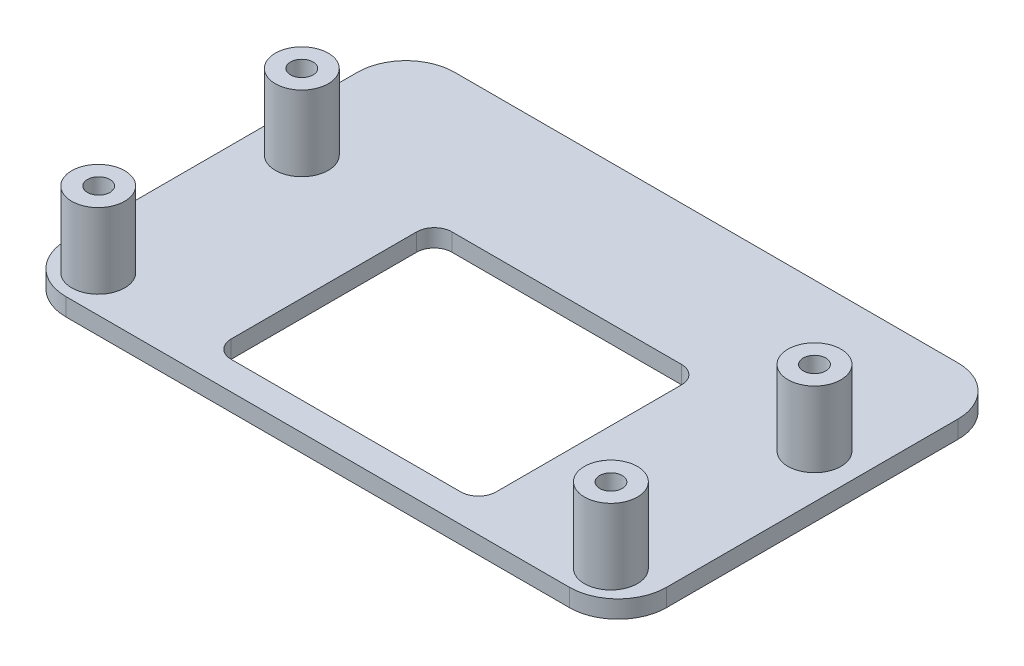
ISO-10303-21;
HEADER;
FILE_DESCRIPTION(('STEP AP214'),'2;1');
FILE_NAME('part.step','',(''),(''),'','','');
FILE_SCHEMA(('AUTOMOTIVE_DESIGN { 1 0 10303 214 1 1 1 1 }'));
ENDSEC;
DATA;
#1=APPLICATION_CONTEXT('core data for automotive mechanical design processes');
#2=APPLICATION_PROTOCOL_DEFINITION('international standard','automotive_design',2000,#1);
#3=PRODUCT_CONTEXT('',#1,'mechanical');
#4=PRODUCT('Part','Part','',(#3));
#5=PRODUCT_RELATED_PRODUCT_CATEGORY('part','',(#4));
#6=PRODUCT_DEFINITION_FORMATION('','',#4);
#7=PRODUCT_DEFINITION_CONTEXT('part definition',#1,'design');
#8=PRODUCT_DEFINITION('design','',#6,#7);
#9=PRODUCT_DEFINITION_SHAPE('','',#8);
#10=(LENGTH_UNIT() NAMED_UNIT(*) SI_UNIT(.MILLI.,.METRE.));
#11=(NAMED_UNIT(*) PLANE_ANGLE_UNIT() SI_UNIT($,.RADIAN.));
#12=(NAMED_UNIT(*) SI_UNIT($,.STERADIAN.) SOLID_ANGLE_UNIT());
#13=UNCERTAINTY_MEASURE_WITH_UNIT(LENGTH_MEASURE(1.E-05),#10,'distance_accuracy_value','');
#14=(GEOMETRIC_REPRESENTATION_CONTEXT(3) GLOBAL_UNCERTAINTY_ASSIGNED_CONTEXT((#13)) GLOBAL_UNIT_ASSIGNED_CONTEXT((#10,
#11,#12)) REPRESENTATION_CONTEXT('',''));
#15=CARTESIAN_POINT('',(0.,0.,0.));
#16=DIRECTION('',(0.,0.,1.));
#17=DIRECTION('',(1.,0.,0.));
#18=AXIS2_PLACEMENT_3D('',#15,#16,#17);
#19=CARTESIAN_POINT('',(-34.4994350282486,2.,-19.3242937853107));
#20=DIRECTION('',(1.,0.,0.));
#21=DIRECTION('',(0.,0.,-1.));
#22=AXIS2_PLACEMENT_3D('',#19,#20,#21);
#23=PLANE('',#22);
#24=DIRECTION('',(0.,0.,1.));
#25=VECTOR('',#24,1.);
#26=CARTESIAN_POINT('',(-34.4994350282486,0.,-19.3242937853107));
#27=LINE('',#26,#25);
#28=CARTESIAN_POINT('',(-34.4994350282486,0.,-13.8242937853107));
#29=VERTEX_POINT('',#28);
#30=CARTESIAN_POINT('',(-34.4994350282486,0.,19.1757062146893));
#31=VERTEX_POINT('',#30);
#32=EDGE_CURVE('E276',#29,#31,#27,.T.);
#33=ORIENTED_EDGE('',*,*,#32,.T.);
#34=DIRECTION('',(0.,-1.,0.));
#35=VECTOR('',#34,1.);
#36=CARTESIAN_POINT('',(-34.4994350282486,2.,19.1757062146893));
#37=LINE('',#36,#35);
#38=CARTESIAN_POINT('',(-34.4994350282486,2.,19.1757062146893));
#39=VERTEX_POINT('',#38);
#40=EDGE_CURVE('E212',#31,#39,#37,.F.);
#41=ORIENTED_EDGE('',*,*,#40,.T.);
#42=DIRECTION('',(0.,0.,1.));
#43=VECTOR('',#42,1.);
#44=CARTESIAN_POINT('',(-34.4994350282486,2.,-19.3242937853107));
#45=LINE('',#44,#43);
#46=CARTESIAN_POINT('',(-34.4994350282486,2.,-13.8242937853107));
#47=VERTEX_POINT('',#46);
#48=EDGE_CURVE('E178',#47,#39,#45,.T.);
#49=ORIENTED_EDGE('',*,*,#48,.F.);
#50=DIRECTION('',(0.,-1.,0.));
#51=VECTOR('',#50,1.);
#52=CARTESIAN_POINT('',(-34.4994350282486,2.,-13.8242937853107));
#53=LINE('',#52,#51);
#54=EDGE_CURVE('E209',#47,#29,#53,.T.);
#55=ORIENTED_EDGE('',*,*,#54,.T.);
#56=EDGE_LOOP('',(#33,#41,#49,#55));
#57=FACE_BOUND('',#56,.T.);
#58=ADVANCED_FACE('F39',(#57),#23,.F.);
#59=CARTESIAN_POINT('',(-34.4994350282486,2.,24.6757062146893));
#60=DIRECTION('',(0.,0.,-1.));
#61=DIRECTION('',(-1.,0.,0.));
#62=AXIS2_PLACEMENT_3D('',#59,#60,#61);
#63=PLANE('',#62);
#64=DIRECTION('',(1.,0.,0.));
#65=VECTOR('',#64,1.);
#66=CARTESIAN_POINT('',(-34.4994350282486,0.,24.6757062146893));
#67=LINE('',#66,#65);
#68=CARTESIAN_POINT('',(-28.9994350282486,0.,24.6757062146893));
#69=VERTEX_POINT('',#68);
#70=CARTESIAN_POINT('',(28.0005649717514,0.,24.6757062146893));
#71=VERTEX_POINT('',#70);
#72=EDGE_CURVE('E184',#69,#71,#67,.T.);
#73=ORIENTED_EDGE('',*,*,#72,.T.);
#74=DIRECTION('',(0.,-1.,0.));
#75=VECTOR('',#74,1.);
#76=CARTESIAN_POINT('',(28.0005649717514,2.,24.6757062146893));
#77=LINE('',#76,#75);
#78=CARTESIAN_POINT('',(28.0005649717514,2.,24.6757062146893));
#79=VERTEX_POINT('',#78);
#80=EDGE_CURVE('E207',#71,#79,#77,.F.);
#81=ORIENTED_EDGE('',*,*,#80,.T.);
#82=DIRECTION('',(1.,0.,0.));
#83=VECTOR('',#82,1.);
#84=CARTESIAN_POINT('',(-34.4994350282486,2.,24.6757062146893));
#85=LINE('',#84,#83);
#86=CARTESIAN_POINT('',(-28.9994350282486,2.,24.6757062146893));
#87=VERTEX_POINT('',#86);
#88=EDGE_CURVE('E182',#87,#79,#85,.T.);
#89=ORIENTED_EDGE('',*,*,#88,.F.);
#90=DIRECTION('',(0.,-1.,0.));
#91=VECTOR('',#90,1.);
#92=CARTESIAN_POINT('',(-28.9994350282486,2.,24.6757062146893));
#93=LINE('',#92,#91);
#94=EDGE_CURVE('E204',#87,#69,#93,.T.);
#95=ORIENTED_EDGE('',*,*,#94,.T.);
#96=EDGE_LOOP('',(#73,#81,#89,#95));
#97=FACE_BOUND('',#96,.T.);
#98=ADVANCED_FACE('F295',(#97),#63,.F.);
#99=CARTESIAN_POINT('',(33.5005649717514,2.,-19.3242937853107));
#100=DIRECTION('',(-1.,0.,0.));
#101=DIRECTION('',(0.,0.,1.));
#102=AXIS2_PLACEMENT_3D('',#99,#100,#101);
#103=PLANE('',#102);
#104=DIRECTION('',(0.,0.,-1.));
#105=VECTOR('',#104,1.);
#106=CARTESIAN_POINT('',(33.5005649717514,0.,-19.3242937853107));
#107=LINE('',#106,#105);
#108=CARTESIAN_POINT('',(33.5005649717514,0.,19.1757062146893));
#109=VERTEX_POINT('',#108);
#110=CARTESIAN_POINT('',(33.5005649717514,0.,-13.8242937853107));
#111=VERTEX_POINT('',#110);
#112=EDGE_CURVE('E179',#109,#111,#107,.T.);
#113=ORIENTED_EDGE('',*,*,#112,.T.);
#114=DIRECTION('',(0.,-1.,0.));
#115=VECTOR('',#114,1.);
#116=CARTESIAN_POINT('',(33.5005649717514,2.,-13.8242937853107));
#117=LINE('',#116,#115);
#118=CARTESIAN_POINT('',(33.5005649717514,2.,-13.8242937853107));
#119=VERTEX_POINT('',#118);
#120=EDGE_CURVE('E157',#111,#119,#117,.F.);
#121=ORIENTED_EDGE('',*,*,#120,.T.);
#122=DIRECTION('',(0.,0.,-1.));
#123=VECTOR('',#122,1.);
#124=CARTESIAN_POINT('',(33.5005649717514,2.,-19.3242937853107));
#125=LINE('',#124,#123);
#126=CARTESIAN_POINT('',(33.5005649717514,2.,19.1757062146893));
#127=VERTEX_POINT('',#126);
#128=EDGE_CURVE('E286',#127,#119,#125,.T.);
#129=ORIENTED_EDGE('',*,*,#128,.F.);
#130=DIRECTION('',(0.,-1.,0.));
#131=VECTOR('',#130,1.);
#132=CARTESIAN_POINT('',(33.5005649717514,2.,19.1757062146893));
#133=LINE('',#132,#131);
#134=EDGE_CURVE('E162',#127,#109,#133,.T.);
#135=ORIENTED_EDGE('',*,*,#134,.T.);
#136=EDGE_LOOP('',(#113,#121,#129,#135));
#137=FACE_BOUND('',#136,.T.);
#138=ADVANCED_FACE('F306',(#137),#103,.F.);
#139=CARTESIAN_POINT('',(-34.4994350282486,2.,-19.3242937853107));
#140=DIRECTION('',(0.,0.,1.));
#141=DIRECTION('',(1.,0.,0.));
#142=AXIS2_PLACEMENT_3D('',#139,#140,#141);
#143=PLANE('',#142);
#144=DIRECTION('',(-1.,0.,0.));
#145=VECTOR('',#144,1.);
#146=CARTESIAN_POINT('',(-34.4994350282486,2.,-19.3242937853107));
#147=LINE('',#146,#145);
#148=CARTESIAN_POINT('',(28.0005649717514,2.,-19.3242937853107));
#149=VERTEX_POINT('',#148);
#150=CARTESIAN_POINT('',(-28.9994350282486,2.,-19.3242937853107));
#151=VERTEX_POINT('',#150);
#152=EDGE_CURVE('E172',#149,#151,#147,.T.);
#153=ORIENTED_EDGE('',*,*,#152,.F.);
#154=DIRECTION('',(0.,-1.,0.));
#155=VECTOR('',#154,1.);
#156=CARTESIAN_POINT('',(28.0005649717514,2.,-19.3242937853107));
#157=LINE('',#156,#155);
#158=CARTESIAN_POINT('',(28.0005649717514,0.,-19.3242937853107));
#159=VERTEX_POINT('',#158);
#160=EDGE_CURVE('E156',#149,#159,#157,.T.);
#161=ORIENTED_EDGE('',*,*,#160,.T.);
#162=DIRECTION('',(-1.,0.,0.));
#163=VECTOR('',#162,1.);
#164=CARTESIAN_POINT('',(-34.4994350282486,0.,-19.3242937853107));
#165=LINE('',#164,#163);
#166=CARTESIAN_POINT('',(-28.9994350282486,0.,-19.3242937853107));
#167=VERTEX_POINT('',#166);
#168=EDGE_CURVE('E169',#159,#167,#165,.T.);
#169=ORIENTED_EDGE('',*,*,#168,.T.);
#170=DIRECTION('',(0.,-1.,0.));
#171=VECTOR('',#170,1.);
#172=CARTESIAN_POINT('',(-28.9994350282486,2.,-19.3242937853107));
#173=LINE('',#172,#171);
#174=EDGE_CURVE('E174',#167,#151,#173,.F.);
#175=ORIENTED_EDGE('',*,*,#174,.T.);
#176=EDGE_LOOP('',(#153,#161,#169,#175));
#177=FACE_BOUND('',#176,.T.);
#178=ADVANCED_FACE('F168',(#177),#143,.F.);
#179=CARTESIAN_POINT('',(0.,2.,0.));
#180=DIRECTION('',(0.,1.,0.));
#181=DIRECTION('',(0.,0.,1.));
#182=AXIS2_PLACEMENT_3D('',#179,#180,#181);
#183=PLANE('',#182);
#184=CARTESIAN_POINT('',(28.5255649717514,2.,-2.54929378531089));
#185=DIRECTION('',(0.,1.,0.));
#186=DIRECTION('',(0.,0.,1.));
#187=AXIS2_PLACEMENT_3D('',#184,#185,#186);
#188=CIRCLE('',#187,3.);
#189=CARTESIAN_POINT('',(28.5255649717514,2.,0.450706214689113));
#190=VERTEX_POINT('',#189);
#191=EDGE_CURVE('E709',#190,#190,#188,.T.);
#192=ORIENTED_EDGE('',*,*,#191,.F.);
#193=EDGE_LOOP('',(#192));
#194=FACE_BOUND('',#193,.T.);
#195=CARTESIAN_POINT('',(28.5005649717514,2.,20.4757062146893));
#196=DIRECTION('',(0.,1.,0.));
#197=DIRECTION('',(0.,0.,1.));
#198=AXIS2_PLACEMENT_3D('',#195,#196,#197);
#199=CIRCLE('',#198,3.);
#200=CARTESIAN_POINT('',(28.5005649717514,2.,23.4757062146893));
#201=VERTEX_POINT('',#200);
#202=EDGE_CURVE('E719',#201,#201,#199,.T.);
#203=ORIENTED_EDGE('',*,*,#202,.F.);
#204=EDGE_LOOP('',(#203));
#205=FACE_BOUND('',#204,.T.);
#206=CARTESIAN_POINT('',(-29.5244350282485,2.,20.5007062146895));
#207=DIRECTION('',(0.,1.,0.));
#208=DIRECTION('',(0.,0.,1.));
#209=AXIS2_PLACEMENT_3D('',#206,#207,#208);
#210=CIRCLE('',#209,3.);
#211=CARTESIAN_POINT('',(-29.5244350282485,2.,23.5007062146895));
#212=VERTEX_POINT('',#211);
#213=EDGE_CURVE('E725',#212,#212,#210,.T.);
#214=ORIENTED_EDGE('',*,*,#213,.F.);
#215=EDGE_LOOP('',(#214));
#216=FACE_BOUND('',#215,.T.);
#217=CARTESIAN_POINT('',(-29.5244350282486,2.,-2.54929378531047));
#218=DIRECTION('',(0.,1.,0.));
#219=DIRECTION('',(0.,0.,1.));
#220=AXIS2_PLACEMENT_3D('',#217,#218,#219);
#221=CIRCLE('',#220,3.);
#222=CARTESIAN_POINT('',(-29.5244350282486,2.,0.450706214689527));
#223=VERTEX_POINT('',#222);
#224=EDGE_CURVE('E269',#223,#223,#221,.T.);
#225=ORIENTED_EDGE('',*,*,#224,.F.);
#226=EDGE_LOOP('',(#225));
#227=FACE_BOUND('',#226,.T.);
#228=DIRECTION('',(1.,0.,0.));
#229=VECTOR('',#228,1.);
#230=CARTESIAN_POINT('',(-15.4994350282486,2.,-3.52429378531069));
#231=LINE('',#230,#229);
#232=CARTESIAN_POINT('',(-13.4994350282486,2.,-3.52429378531069));
#233=VERTEX_POINT('',#232);
#234=CARTESIAN_POINT('',(12.5005649717514,2.,-3.52429378531069));
#235=VERTEX_POINT('',#234);
#236=EDGE_CURVE('E274',#233,#235,#231,.T.);
#237=ORIENTED_EDGE('',*,*,#236,.T.);
#238=CARTESIAN_POINT('',(12.5005649717514,2.,-1.52429378531069));
#239=DIRECTION('',(0.,1.,0.));
#240=DIRECTION('',(0.,0.,1.));
#241=AXIS2_PLACEMENT_3D('',#238,#239,#240);
#242=CIRCLE('',#241,2.);
#243=CARTESIAN_POINT('',(14.5005649717514,2.,-1.52429378531069));
#244=VERTEX_POINT('',#243);
#245=EDGE_CURVE('E11',#235,#244,#242,.F.);
#246=ORIENTED_EDGE('',*,*,#245,.T.);
#247=DIRECTION('',(0.,0.,1.));
#248=VECTOR('',#247,1.);
#249=CARTESIAN_POINT('',(14.5005649717514,2.,21.4757062146893));
#250=LINE('',#249,#248);
#251=CARTESIAN_POINT('',(14.5005649717514,2.,19.4757062146893));
#252=VERTEX_POINT('',#251);
#253=EDGE_CURVE('E258',#244,#252,#250,.T.);
#254=ORIENTED_EDGE('',*,*,#253,.T.);
#255=CARTESIAN_POINT('',(12.5005649717514,2.,19.4757062146893));
#256=DIRECTION('',(0.,1.,0.));
#257=DIRECTION('',(0.,0.,1.));
#258=AXIS2_PLACEMENT_3D('',#255,#256,#257);
#259=CIRCLE('',#258,2.);
#260=CARTESIAN_POINT('',(12.5005649717514,2.,21.4757062146893));
#261=VERTEX_POINT('',#260);
#262=EDGE_CURVE('E243',#252,#261,#259,.F.);
#263=ORIENTED_EDGE('',*,*,#262,.T.);
#264=DIRECTION('',(-1.,0.,0.));
#265=VECTOR('',#264,1.);
#266=CARTESIAN_POINT('',(-15.4994350282486,2.,21.4757062146893));
#267=LINE('',#266,#265);
#268=CARTESIAN_POINT('',(-13.4994350282486,2.,21.4757062146893));
#269=VERTEX_POINT('',#268);
#270=EDGE_CURVE('E263',#261,#269,#267,.T.);
#271=ORIENTED_EDGE('',*,*,#270,.T.);
#272=CARTESIAN_POINT('',(-13.4994350282486,2.,19.4757062146893));
#273=DIRECTION('',(0.,1.,0.));
#274=DIRECTION('',(0.,0.,1.));
#275=AXIS2_PLACEMENT_3D('',#272,#273,#274);
#276=CIRCLE('',#275,2.);
#277=CARTESIAN_POINT('',(-15.4994350282486,2.,19.4757062146893));
#278=VERTEX_POINT('',#277);
#279=EDGE_CURVE('E239',#269,#278,#276,.F.);
#280=ORIENTED_EDGE('',*,*,#279,.T.);
#281=DIRECTION('',(0.,0.,-1.));
#282=VECTOR('',#281,1.);
#283=CARTESIAN_POINT('',(-15.4994350282486,2.,21.4757062146893));
#284=LINE('',#283,#282);
#285=CARTESIAN_POINT('',(-15.4994350282486,2.,-1.52429378531069));
#286=VERTEX_POINT('',#285);
#287=EDGE_CURVE('E266',#278,#286,#284,.T.);
#288=ORIENTED_EDGE('',*,*,#287,.T.);
#289=CARTESIAN_POINT('',(-13.4994350282486,2.,-1.52429378531069));
#290=DIRECTION('',(0.,1.,0.));
#291=DIRECTION('',(0.,0.,1.));
#292=AXIS2_PLACEMENT_3D('',#289,#290,#291);
#293=CIRCLE('',#292,2.);
#294=EDGE_CURVE('E235',#286,#233,#293,.F.);
#295=ORIENTED_EDGE('',*,*,#294,.T.);
#296=EDGE_LOOP('',(#237,#246,#254,#263,#271,#280,#288,#295));
#297=FACE_BOUND('',#296,.T.);
#298=ORIENTED_EDGE('',*,*,#128,.T.);
#299=CARTESIAN_POINT('',(28.0005649717514,2.,-13.8242937853107));
#300=DIRECTION('',(0.,1.,0.));
#301=DIRECTION('',(0.,0.,1.));
#302=AXIS2_PLACEMENT_3D('',#299,#300,#301);
#303=CIRCLE('',#302,5.5);
#304=EDGE_CURVE('E202',#119,#149,#303,.T.);
#305=ORIENTED_EDGE('',*,*,#304,.T.);
#306=ORIENTED_EDGE('',*,*,#152,.T.);
#307=CARTESIAN_POINT('',(-28.9994350282486,2.,-13.8242937853107));
#308=DIRECTION('',(0.,1.,0.));
#309=DIRECTION('',(0.,0.,1.));
#310=AXIS2_PLACEMENT_3D('',#307,#308,#309);
#311=CIRCLE('',#310,5.5);
#312=EDGE_CURVE('E196',#151,#47,#311,.T.);
#313=ORIENTED_EDGE('',*,*,#312,.T.);
#314=ORIENTED_EDGE('',*,*,#48,.T.);
#315=CARTESIAN_POINT('',(-28.9994350282486,2.,19.1757062146893));
#316=DIRECTION('',(0.,1.,0.));
#317=DIRECTION('',(0.,0.,1.));
#318=AXIS2_PLACEMENT_3D('',#315,#316,#317);
#319=CIRCLE('',#318,5.5);
#320=EDGE_CURVE('E198',#39,#87,#319,.T.);
#321=ORIENTED_EDGE('',*,*,#320,.T.);
#322=ORIENTED_EDGE('',*,*,#88,.T.);
#323=CARTESIAN_POINT('',(28.0005649717514,2.,19.1757062146893));
#324=DIRECTION('',(0.,1.,0.));
#325=DIRECTION('',(0.,0.,1.));
#326=AXIS2_PLACEMENT_3D('',#323,#324,#325);
#327=CIRCLE('',#326,5.5);
#328=EDGE_CURVE('E200',#79,#127,#327,.T.);
#329=ORIENTED_EDGE('',*,*,#328,.T.);
#330=EDGE_LOOP('',(#298,#305,#306,#313,#314,#321,#322,#329));
#331=FACE_BOUND('',#330,.T.);
#332=ADVANCED_FACE('F304',(#194,#205,#216,#227,#297,#331),#183,.T.);
#333=CARTESIAN_POINT('',(0.,0.,0.));
#334=DIRECTION('',(0.,1.,0.));
#335=DIRECTION('',(0.,0.,1.));
#336=AXIS2_PLACEMENT_3D('',#333,#334,#335);
#337=PLANE('',#336);
#338=DIRECTION('',(-1.,0.,0.));
#339=VECTOR('',#338,1.);
#340=CARTESIAN_POINT('',(-15.4994350282486,0.,21.4757062146893));
#341=LINE('',#340,#339);
#342=CARTESIAN_POINT('',(12.5005649717514,0.,21.4757062146893));
#343=VERTEX_POINT('',#342);
#344=CARTESIAN_POINT('',(-13.4994350282486,0.,21.4757062146893));
#345=VERTEX_POINT('',#344);
#346=EDGE_CURVE('E278',#343,#345,#341,.T.);
#347=ORIENTED_EDGE('',*,*,#346,.F.);
#348=CARTESIAN_POINT('',(12.5005649717514,0.,19.4757062146893));
#349=DIRECTION('',(0.,1.,0.));
#350=DIRECTION('',(0.,0.,1.));
#351=AXIS2_PLACEMENT_3D('',#348,#349,#350);
#352=CIRCLE('',#351,2.);
#353=CARTESIAN_POINT('',(14.5005649717514,0.,19.4757062146893));
#354=VERTEX_POINT('',#353);
#355=EDGE_CURVE('E241',#343,#354,#352,.T.);
#356=ORIENTED_EDGE('',*,*,#355,.T.);
#357=DIRECTION('',(0.,0.,1.));
#358=VECTOR('',#357,1.);
#359=CARTESIAN_POINT('',(14.5005649717514,0.,21.4757062146893));
#360=LINE('',#359,#358);
#361=CARTESIAN_POINT('',(14.5005649717514,0.,-1.52429378531069));
#362=VERTEX_POINT('',#361);
#363=EDGE_CURVE('E250',#362,#354,#360,.T.);
#364=ORIENTED_EDGE('',*,*,#363,.F.);
#365=CARTESIAN_POINT('',(12.5005649717514,0.,-1.52429378531069));
#366=DIRECTION('',(0.,1.,0.));
#367=DIRECTION('',(0.,0.,1.));
#368=AXIS2_PLACEMENT_3D('',#365,#366,#367);
#369=CIRCLE('',#368,2.);
#370=CARTESIAN_POINT('',(12.5005649717514,0.,-3.52429378531069));
#371=VERTEX_POINT('',#370);
#372=EDGE_CURVE('E47',#362,#371,#369,.T.);
#373=ORIENTED_EDGE('',*,*,#372,.T.);
#374=DIRECTION('',(1.,0.,0.));
#375=VECTOR('',#374,1.);
#376=CARTESIAN_POINT('',(-15.4994350282486,0.,-3.52429378531069));
#377=LINE('',#376,#375);
#378=CARTESIAN_POINT('',(-13.4994350282486,0.,-3.52429378531069));
#379=VERTEX_POINT('',#378);
#380=EDGE_CURVE('E249',#379,#371,#377,.T.);
#381=ORIENTED_EDGE('',*,*,#380,.F.);
#382=CARTESIAN_POINT('',(-13.4994350282486,0.,-1.52429378531069));
#383=DIRECTION('',(0.,1.,0.));
#384=DIRECTION('',(0.,0.,1.));
#385=AXIS2_PLACEMENT_3D('',#382,#383,#384);
#386=CIRCLE('',#385,2.);
#387=CARTESIAN_POINT('',(-15.4994350282486,0.,-1.52429378531069));
#388=VERTEX_POINT('',#387);
#389=EDGE_CURVE('E233',#379,#388,#386,.T.);
#390=ORIENTED_EDGE('',*,*,#389,.T.);
#391=DIRECTION('',(0.,0.,-1.));
#392=VECTOR('',#391,1.);
#393=CARTESIAN_POINT('',(-15.4994350282486,0.,21.4757062146893));
#394=LINE('',#393,#392);
#395=CARTESIAN_POINT('',(-15.4994350282486,0.,19.4757062146893));
#396=VERTEX_POINT('',#395);
#397=EDGE_CURVE('E259',#396,#388,#394,.T.);
#398=ORIENTED_EDGE('',*,*,#397,.F.);
#399=CARTESIAN_POINT('',(-13.4994350282486,0.,19.4757062146893));
#400=DIRECTION('',(0.,1.,0.));
#401=DIRECTION('',(0.,0.,1.));
#402=AXIS2_PLACEMENT_3D('',#399,#400,#401);
#403=CIRCLE('',#402,2.);
#404=EDGE_CURVE('E237',#396,#345,#403,.T.);
#405=ORIENTED_EDGE('',*,*,#404,.T.);
#406=EDGE_LOOP('',(#347,#356,#364,#373,#381,#390,#398,#405));
#407=FACE_BOUND('',#406,.T.);
#408=ORIENTED_EDGE('',*,*,#168,.F.);
#409=CARTESIAN_POINT('',(28.0005649717514,0.,-13.8242937853107));
#410=DIRECTION('',(0.,1.,0.));
#411=DIRECTION('',(0.,0.,1.));
#412=AXIS2_PLACEMENT_3D('',#409,#410,#411);
#413=CIRCLE('',#412,5.5);
#414=EDGE_CURVE('E152',#159,#111,#413,.F.);
#415=ORIENTED_EDGE('',*,*,#414,.T.);
#416=ORIENTED_EDGE('',*,*,#112,.F.);
#417=CARTESIAN_POINT('',(28.0005649717514,0.,19.1757062146893));
#418=DIRECTION('',(0.,1.,0.));
#419=DIRECTION('',(0.,0.,1.));
#420=AXIS2_PLACEMENT_3D('',#417,#418,#419);
#421=CIRCLE('',#420,5.5);
#422=EDGE_CURVE('E163',#109,#71,#421,.F.);
#423=ORIENTED_EDGE('',*,*,#422,.T.);
#424=ORIENTED_EDGE('',*,*,#72,.F.);
#425=CARTESIAN_POINT('',(-28.9994350282486,0.,19.1757062146893));
#426=DIRECTION('',(0.,1.,0.));
#427=DIRECTION('',(0.,0.,1.));
#428=AXIS2_PLACEMENT_3D('',#425,#426,#427);
#429=CIRCLE('',#428,5.5);
#430=EDGE_CURVE('E190',#69,#31,#429,.F.);
#431=ORIENTED_EDGE('',*,*,#430,.T.);
#432=ORIENTED_EDGE('',*,*,#32,.F.);
#433=CARTESIAN_POINT('',(-28.9994350282486,0.,-13.8242937853107));
#434=DIRECTION('',(0.,1.,0.));
#435=DIRECTION('',(0.,0.,1.));
#436=AXIS2_PLACEMENT_3D('',#433,#434,#435);
#437=CIRCLE('',#436,5.5);
#438=EDGE_CURVE('E173',#29,#167,#437,.F.);
#439=ORIENTED_EDGE('',*,*,#438,.T.);
#440=EDGE_LOOP('',(#408,#415,#416,#423,#424,#431,#432,#439));
#441=FACE_BOUND('',#440,.T.);
#442=ADVANCED_FACE('F176',(#407,#441),#337,.F.);
#443=CARTESIAN_POINT('',(28.0005649717514,2.,-13.8242937853107));
#444=DIRECTION('',(0.,-1.,0.));
#445=DIRECTION('',(0.,0.,-1.));
#446=AXIS2_PLACEMENT_3D('',#443,#444,#445);
#447=CYLINDRICAL_SURFACE('',#446,5.5);
#448=ORIENTED_EDGE('',*,*,#304,.F.);
#449=ORIENTED_EDGE('',*,*,#120,.F.);
#450=ORIENTED_EDGE('',*,*,#414,.F.);
#451=ORIENTED_EDGE('',*,*,#160,.F.);
#452=EDGE_LOOP('',(#448,#449,#450,#451));
#453=FACE_BOUND('',#452,.T.);
#454=ADVANCED_FACE('F155',(#453),#447,.T.);
#455=CARTESIAN_POINT('',(28.0005649717514,2.,19.1757062146893));
#456=DIRECTION('',(0.,-1.,0.));
#457=DIRECTION('',(0.,0.,-1.));
#458=AXIS2_PLACEMENT_3D('',#455,#456,#457);
#459=CYLINDRICAL_SURFACE('',#458,5.5);
#460=ORIENTED_EDGE('',*,*,#328,.F.);
#461=ORIENTED_EDGE('',*,*,#80,.F.);
#462=ORIENTED_EDGE('',*,*,#422,.F.);
#463=ORIENTED_EDGE('',*,*,#134,.F.);
#464=EDGE_LOOP('',(#460,#461,#462,#463));
#465=FACE_BOUND('',#464,.T.);
#466=ADVANCED_FACE('F300',(#465),#459,.T.);
#467=CARTESIAN_POINT('',(-28.9994350282486,2.,19.1757062146893));
#468=DIRECTION('',(0.,-1.,0.));
#469=DIRECTION('',(0.,0.,-1.));
#470=AXIS2_PLACEMENT_3D('',#467,#468,#469);
#471=CYLINDRICAL_SURFACE('',#470,5.5);
#472=ORIENTED_EDGE('',*,*,#320,.F.);
#473=ORIENTED_EDGE('',*,*,#40,.F.);
#474=ORIENTED_EDGE('',*,*,#430,.F.);
#475=ORIENTED_EDGE('',*,*,#94,.F.);
#476=EDGE_LOOP('',(#472,#473,#474,#475));
#477=FACE_BOUND('',#476,.T.);
#478=ADVANCED_FACE('F325',(#477),#471,.T.);
#479=CARTESIAN_POINT('',(-28.9994350282486,2.,-13.8242937853107));
#480=DIRECTION('',(0.,-1.,0.));
#481=DIRECTION('',(0.,0.,-1.));
#482=AXIS2_PLACEMENT_3D('',#479,#480,#481);
#483=CYLINDRICAL_SURFACE('',#482,5.5);
#484=ORIENTED_EDGE('',*,*,#312,.F.);
#485=ORIENTED_EDGE('',*,*,#174,.F.);
#486=ORIENTED_EDGE('',*,*,#438,.F.);
#487=ORIENTED_EDGE('',*,*,#54,.F.);
#488=EDGE_LOOP('',(#484,#485,#486,#487));
#489=FACE_BOUND('',#488,.T.);
#490=ADVANCED_FACE('F328',(#489),#483,.T.);
#491=CARTESIAN_POINT('',(14.5005649717514,2.,21.4757062146893));
#492=DIRECTION('',(1.,0.,0.));
#493=DIRECTION('',(0.,0.,-1.));
#494=AXIS2_PLACEMENT_3D('',#491,#492,#493);
#495=PLANE('',#494);
#496=ORIENTED_EDGE('',*,*,#363,.T.);
#497=DIRECTION('',(0.,-1.,0.));
#498=VECTOR('',#497,1.);
#499=CARTESIAN_POINT('',(14.5005649717514,2.,19.4757062146893));
#500=LINE('',#499,#498);
#501=EDGE_CURVE('E54',#354,#252,#500,.F.);
#502=ORIENTED_EDGE('',*,*,#501,.T.);
#503=ORIENTED_EDGE('',*,*,#253,.F.);
#504=DIRECTION('',(0.,-1.,0.));
#505=VECTOR('',#504,1.);
#506=CARTESIAN_POINT('',(14.5005649717514,0.,-1.52429378531069));
#507=LINE('',#506,#505);
#508=EDGE_CURVE('E229',#244,#362,#507,.T.);
#509=ORIENTED_EDGE('',*,*,#508,.T.);
#510=EDGE_LOOP('',(#496,#502,#503,#509));
#511=FACE_BOUND('',#510,.T.);
#512=ADVANCED_FACE('F261',(#511),#495,.F.);
#513=CARTESIAN_POINT('',(-15.4994350282486,2.,-3.52429378531069));
#514=DIRECTION('',(0.,0.,-1.));
#515=DIRECTION('',(-1.,0.,0.));
#516=AXIS2_PLACEMENT_3D('',#513,#514,#515);
#517=PLANE('',#516);
#518=ORIENTED_EDGE('',*,*,#236,.F.);
#519=DIRECTION('',(0.,-1.,0.));
#520=VECTOR('',#519,1.);
#521=CARTESIAN_POINT('',(-13.4994350282486,0.,-3.52429378531069));
#522=LINE('',#521,#520);
#523=EDGE_CURVE('E216',#233,#379,#522,.T.);
#524=ORIENTED_EDGE('',*,*,#523,.T.);
#525=ORIENTED_EDGE('',*,*,#380,.T.);
#526=DIRECTION('',(0.,-1.,0.));
#527=VECTOR('',#526,1.);
#528=CARTESIAN_POINT('',(12.5005649717514,2.,-3.52429378531069));
#529=LINE('',#528,#527);
#530=EDGE_CURVE('E214',#371,#235,#529,.F.);
#531=ORIENTED_EDGE('',*,*,#530,.T.);
#532=EDGE_LOOP('',(#518,#524,#525,#531));
#533=FACE_BOUND('',#532,.T.);
#534=ADVANCED_FACE('F256',(#533),#517,.F.);
#535=CARTESIAN_POINT('',(-15.4994350282486,2.,21.4757062146893));
#536=DIRECTION('',(-1.,0.,0.));
#537=DIRECTION('',(0.,0.,1.));
#538=AXIS2_PLACEMENT_3D('',#535,#536,#537);
#539=PLANE('',#538);
#540=ORIENTED_EDGE('',*,*,#397,.T.);
#541=DIRECTION('',(0.,-1.,0.));
#542=VECTOR('',#541,1.);
#543=CARTESIAN_POINT('',(-15.4994350282486,2.,-1.52429378531069));
#544=LINE('',#543,#542);
#545=EDGE_CURVE('E222',#388,#286,#544,.F.);
#546=ORIENTED_EDGE('',*,*,#545,.T.);
#547=ORIENTED_EDGE('',*,*,#287,.F.);
#548=DIRECTION('',(0.,-1.,0.));
#549=VECTOR('',#548,1.);
#550=CARTESIAN_POINT('',(-15.4994350282486,0.,19.4757062146893));
#551=LINE('',#550,#549);
#552=EDGE_CURVE('E219',#278,#396,#551,.T.);
#553=ORIENTED_EDGE('',*,*,#552,.T.);
#554=EDGE_LOOP('',(#540,#546,#547,#553));
#555=FACE_BOUND('',#554,.T.);
#556=ADVANCED_FACE('F357',(#555),#539,.F.);
#557=CARTESIAN_POINT('',(-15.4994350282486,2.,21.4757062146893));
#558=DIRECTION('',(0.,0.,1.));
#559=DIRECTION('',(1.,0.,0.));
#560=AXIS2_PLACEMENT_3D('',#557,#558,#559);
#561=PLANE('',#560);
#562=ORIENTED_EDGE('',*,*,#346,.T.);
#563=DIRECTION('',(0.,-1.,0.));
#564=VECTOR('',#563,1.);
#565=CARTESIAN_POINT('',(-13.4994350282486,2.,21.4757062146893));
#566=LINE('',#565,#564);
#567=EDGE_CURVE('E227',#345,#269,#566,.F.);
#568=ORIENTED_EDGE('',*,*,#567,.T.);
#569=ORIENTED_EDGE('',*,*,#270,.F.);
#570=DIRECTION('',(0.,-1.,0.));
#571=VECTOR('',#570,1.);
#572=CARTESIAN_POINT('',(12.5005649717514,0.,21.4757062146893));
#573=LINE('',#572,#571);
#574=EDGE_CURVE('E224',#261,#343,#573,.T.);
#575=ORIENTED_EDGE('',*,*,#574,.T.);
#576=EDGE_LOOP('',(#562,#568,#569,#575));
#577=FACE_BOUND('',#576,.T.);
#578=ADVANCED_FACE('F337',(#577),#561,.F.);
#579=CARTESIAN_POINT('',(-13.4994350282486,2.,-1.52429378531069));
#580=DIRECTION('',(0.,1.,0.));
#581=DIRECTION('',(0.,0.,1.));
#582=AXIS2_PLACEMENT_3D('',#579,#580,#581);
#583=CYLINDRICAL_SURFACE('',#582,2.);
#584=ORIENTED_EDGE('',*,*,#294,.F.);
#585=ORIENTED_EDGE('',*,*,#545,.F.);
#586=ORIENTED_EDGE('',*,*,#389,.F.);
#587=ORIENTED_EDGE('',*,*,#523,.F.);
#588=EDGE_LOOP('',(#584,#585,#586,#587));
#589=FACE_BOUND('',#588,.T.);
#590=ADVANCED_FACE('F333',(#589),#583,.F.);
#591=CARTESIAN_POINT('',(-13.4994350282486,2.,19.4757062146893));
#592=DIRECTION('',(0.,1.,0.));
#593=DIRECTION('',(0.,0.,1.));
#594=AXIS2_PLACEMENT_3D('',#591,#592,#593);
#595=CYLINDRICAL_SURFACE('',#594,2.);
#596=ORIENTED_EDGE('',*,*,#279,.F.);
#597=ORIENTED_EDGE('',*,*,#567,.F.);
#598=ORIENTED_EDGE('',*,*,#404,.F.);
#599=ORIENTED_EDGE('',*,*,#552,.F.);
#600=EDGE_LOOP('',(#596,#597,#598,#599));
#601=FACE_BOUND('',#600,.T.);
#602=ADVANCED_FACE('F336',(#601),#595,.F.);
#603=CARTESIAN_POINT('',(12.5005649717514,2.,19.4757062146893));
#604=DIRECTION('',(0.,1.,0.));
#605=DIRECTION('',(0.,0.,1.));
#606=AXIS2_PLACEMENT_3D('',#603,#604,#605);
#607=CYLINDRICAL_SURFACE('',#606,2.);
#608=ORIENTED_EDGE('',*,*,#262,.F.);
#609=ORIENTED_EDGE('',*,*,#501,.F.);
#610=ORIENTED_EDGE('',*,*,#355,.F.);
#611=ORIENTED_EDGE('',*,*,#574,.F.);
#612=EDGE_LOOP('',(#608,#609,#610,#611));
#613=FACE_BOUND('',#612,.T.);
#614=ADVANCED_FACE('F340',(#613),#607,.F.);
#615=CARTESIAN_POINT('',(12.5005649717514,2.,-1.52429378531069));
#616=DIRECTION('',(0.,1.,0.));
#617=DIRECTION('',(0.,0.,1.));
#618=AXIS2_PLACEMENT_3D('',#615,#616,#617);
#619=CYLINDRICAL_SURFACE('',#618,2.);
#620=ORIENTED_EDGE('',*,*,#245,.F.);
#621=ORIENTED_EDGE('',*,*,#530,.F.);
#622=ORIENTED_EDGE('',*,*,#372,.F.);
#623=ORIENTED_EDGE('',*,*,#508,.F.);
#624=EDGE_LOOP('',(#620,#621,#622,#623));
#625=FACE_BOUND('',#624,.T.);
#626=ADVANCED_FACE('F41',(#625),#619,.F.);
#627=CARTESIAN_POINT('',(-29.5244350282486,10.5,-2.54929378531047));
#628=DIRECTION('',(0.,-1.,0.));
#629=DIRECTION('',(0.,0.,-1.));
#630=AXIS2_PLACEMENT_3D('',#627,#628,#629);
#631=CYLINDRICAL_SURFACE('',#630,3.);
#632=CARTESIAN_POINT('',(-29.5244350282486,10.5,-2.54929378531047));
#633=DIRECTION('',(0.,1.,0.));
#634=DIRECTION('',(0.,0.,1.));
#635=AXIS2_PLACEMENT_3D('',#632,#633,#634);
#636=CIRCLE('',#635,3.);
#637=CARTESIAN_POINT('',(-29.5244350282486,10.5,0.450706214689527));
#638=VERTEX_POINT('',#637);
#639=EDGE_CURVE('E279',#638,#638,#636,.T.);
#640=ORIENTED_EDGE('',*,*,#639,.F.);
#641=EDGE_LOOP('',(#640));
#642=FACE_BOUND('',#641,.T.);
#643=ORIENTED_EDGE('',*,*,#224,.T.);
#644=EDGE_LOOP('',(#643));
#645=FACE_BOUND('',#644,.T.);
#646=ADVANCED_FACE('F347',(#642,#645),#631,.T.);
#647=CARTESIAN_POINT('',(-29.5244350282486,10.5,-2.54929378531047));
#648=DIRECTION('',(0.,1.,0.));
#649=DIRECTION('',(0.,0.,1.));
#650=AXIS2_PLACEMENT_3D('',#647,#648,#649);
#651=PLANE('',#650);
#652=CARTESIAN_POINT('',(-29.5244350282486,10.5,-2.54929378531047));
#653=DIRECTION('',(0.,1.,0.));
#654=DIRECTION('',(0.,0.,1.));
#655=AXIS2_PLACEMENT_3D('',#652,#653,#654);
#656=CIRCLE('',#655,1.275);
#657=CARTESIAN_POINT('',(-29.5244350282486,10.5,-1.27429378531047));
#658=VERTEX_POINT('',#657);
#659=EDGE_CURVE('E706',#658,#658,#656,.T.);
#660=ORIENTED_EDGE('',*,*,#659,.F.);
#661=EDGE_LOOP('',(#660));
#662=FACE_BOUND('',#661,.T.);
#663=ORIENTED_EDGE('',*,*,#639,.T.);
#664=EDGE_LOOP('',(#663));
#665=FACE_BOUND('',#664,.T.);
#666=ADVANCED_FACE('F446',(#662,#665),#651,.T.);
#667=CARTESIAN_POINT('',(-29.5244350282485,10.5,20.5007062146895));
#668=DIRECTION('',(0.,-1.,0.));
#669=DIRECTION('',(0.,0.,-1.));
#670=AXIS2_PLACEMENT_3D('',#667,#668,#669);
#671=CYLINDRICAL_SURFACE('',#670,3.);
#672=CARTESIAN_POINT('',(-29.5244350282485,10.5,20.5007062146895));
#673=DIRECTION('',(0.,1.,0.));
#674=DIRECTION('',(0.,0.,1.));
#675=AXIS2_PLACEMENT_3D('',#672,#673,#674);
#676=CIRCLE('',#675,3.);
#677=CARTESIAN_POINT('',(-29.5244350282485,10.5,23.5007062146895));
#678=VERTEX_POINT('',#677);
#679=EDGE_CURVE('E722',#678,#678,#676,.T.);
#680=ORIENTED_EDGE('',*,*,#679,.F.);
#681=EDGE_LOOP('',(#680));
#682=FACE_BOUND('',#681,.T.);
#683=ORIENTED_EDGE('',*,*,#213,.T.);
#684=EDGE_LOOP('',(#683));
#685=FACE_BOUND('',#684,.T.);
#686=ADVANCED_FACE('F454',(#682,#685),#671,.T.);
#687=CARTESIAN_POINT('',(-29.5244350282485,10.5,20.5007062146895));
#688=DIRECTION('',(0.,1.,0.));
#689=DIRECTION('',(0.,0.,1.));
#690=AXIS2_PLACEMENT_3D('',#687,#688,#689);
#691=PLANE('',#690);
#692=CARTESIAN_POINT('',(-29.4994350282486,10.5,20.4757062146893));
#693=DIRECTION('',(0.,1.,0.));
#694=DIRECTION('',(0.,0.,1.));
#695=AXIS2_PLACEMENT_3D('',#692,#693,#694);
#696=CIRCLE('',#695,1.275);
#697=CARTESIAN_POINT('',(-29.4994350282486,10.5,21.7507062146893));
#698=VERTEX_POINT('',#697);
#699=EDGE_CURVE('E712',#698,#698,#696,.T.);
#700=ORIENTED_EDGE('',*,*,#699,.F.);
#701=EDGE_LOOP('',(#700));
#702=FACE_BOUND('',#701,.T.);
#703=ORIENTED_EDGE('',*,*,#679,.T.);
#704=EDGE_LOOP('',(#703));
#705=FACE_BOUND('',#704,.T.);
#706=ADVANCED_FACE('F459',(#702,#705),#691,.T.);
#707=CARTESIAN_POINT('',(28.5005649717514,10.5,20.4757062146893));
#708=DIRECTION('',(0.,-1.,0.));
#709=DIRECTION('',(0.,0.,-1.));
#710=AXIS2_PLACEMENT_3D('',#707,#708,#709);
#711=CYLINDRICAL_SURFACE('',#710,3.);
#712=CARTESIAN_POINT('',(28.5005649717514,10.5,20.4757062146893));
#713=DIRECTION('',(0.,1.,0.));
#714=DIRECTION('',(0.,0.,1.));
#715=AXIS2_PLACEMENT_3D('',#712,#713,#714);
#716=CIRCLE('',#715,3.);
#717=CARTESIAN_POINT('',(28.5005649717514,10.5,23.4757062146893));
#718=VERTEX_POINT('',#717);
#719=EDGE_CURVE('E717',#718,#718,#716,.T.);
#720=ORIENTED_EDGE('',*,*,#719,.F.);
#721=EDGE_LOOP('',(#720));
#722=FACE_BOUND('',#721,.T.);
#723=ORIENTED_EDGE('',*,*,#202,.T.);
#724=EDGE_LOOP('',(#723));
#725=FACE_BOUND('',#724,.T.);
#726=ADVANCED_FACE('F468',(#722,#725),#711,.T.);
#727=CARTESIAN_POINT('',(28.5005649717514,10.5,20.4757062146893));
#728=DIRECTION('',(0.,1.,0.));
#729=DIRECTION('',(0.,0.,1.));
#730=AXIS2_PLACEMENT_3D('',#727,#728,#729);
#731=PLANE('',#730);
#732=CARTESIAN_POINT('',(28.5255649717515,10.5,20.5007062146891));
#733=DIRECTION('',(0.,1.,0.));
#734=DIRECTION('',(0.,0.,1.));
#735=AXIS2_PLACEMENT_3D('',#732,#733,#734);
#736=CIRCLE('',#735,1.275);
#737=CARTESIAN_POINT('',(28.5255649717515,10.5,21.7757062146891));
#738=VERTEX_POINT('',#737);
#739=EDGE_CURVE('E755',#738,#738,#736,.T.);
#740=ORIENTED_EDGE('',*,*,#739,.F.);
#741=EDGE_LOOP('',(#740));
#742=FACE_BOUND('',#741,.T.);
#743=ORIENTED_EDGE('',*,*,#719,.T.);
#744=EDGE_LOOP('',(#743));
#745=FACE_BOUND('',#744,.T.);
#746=ADVANCED_FACE('F473',(#742,#745),#731,.T.);
#747=CARTESIAN_POINT('',(28.5255649717514,10.5,-2.54929378531089));
#748=DIRECTION('',(0.,-1.,0.));
#749=DIRECTION('',(0.,0.,-1.));
#750=AXIS2_PLACEMENT_3D('',#747,#748,#749);
#751=CYLINDRICAL_SURFACE('',#750,3.);
#752=CARTESIAN_POINT('',(28.5255649717514,10.5,-2.54929378531089));
#753=DIRECTION('',(0.,1.,0.));
#754=DIRECTION('',(0.,0.,1.));
#755=AXIS2_PLACEMENT_3D('',#752,#753,#754);
#756=CIRCLE('',#755,3.);
#757=CARTESIAN_POINT('',(28.5255649717514,10.5,0.450706214689113));
#758=VERTEX_POINT('',#757);
#759=EDGE_CURVE('E705',#758,#758,#756,.T.);
#760=ORIENTED_EDGE('',*,*,#759,.F.);
#761=EDGE_LOOP('',(#760));
#762=FACE_BOUND('',#761,.T.);
#763=ORIENTED_EDGE('',*,*,#191,.T.);
#764=EDGE_LOOP('',(#763));
#765=FACE_BOUND('',#764,.T.);
#766=ADVANCED_FACE('F482',(#762,#765),#751,.T.);
#767=CARTESIAN_POINT('',(28.5255649717514,10.5,-2.54929378531089));
#768=DIRECTION('',(0.,1.,0.));
#769=DIRECTION('',(0.,0.,1.));
#770=AXIS2_PLACEMENT_3D('',#767,#768,#769);
#771=PLANE('',#770);
#772=CARTESIAN_POINT('',(28.5255649717514,10.5,-2.54929378531089));
#773=DIRECTION('',(0.,1.,0.));
#774=DIRECTION('',(0.,0.,1.));
#775=AXIS2_PLACEMENT_3D('',#772,#773,#774);
#776=CIRCLE('',#775,1.275);
#777=CARTESIAN_POINT('',(28.5255649717514,10.5,-1.27429378531089));
#778=VERTEX_POINT('',#777);
#779=EDGE_CURVE('E748',#778,#778,#776,.T.);
#780=ORIENTED_EDGE('',*,*,#779,.F.);
#781=EDGE_LOOP('',(#780));
#782=FACE_BOUND('',#781,.T.);
#783=ORIENTED_EDGE('',*,*,#759,.T.);
#784=EDGE_LOOP('',(#783));
#785=FACE_BOUND('',#784,.T.);
#786=ADVANCED_FACE('F487',(#782,#785),#771,.T.);
#787=CARTESIAN_POINT('',(28.5255649717514,10.5,-2.54929378531089));
#788=DIRECTION('',(0.,1.,0.));
#789=DIRECTION('',(0.,0.,1.));
#790=AXIS2_PLACEMENT_3D('',#787,#788,#789);
#791=CONICAL_SURFACE('',#790,1.275,0.0349065850398866);
#792=CARTESIAN_POINT('',(28.5255649717514,4.5,-2.54929378531089));
#793=DIRECTION('',(0.,1.,0.));
#794=DIRECTION('',(0.,0.,1.));
#795=AXIS2_PLACEMENT_3D('',#792,#793,#794);
#796=CIRCLE('',#795,1.06547538304951);
#797=CARTESIAN_POINT('',(28.5255649717514,4.5,-1.48381840226138));
#798=VERTEX_POINT('',#797);
#799=EDGE_CURVE('E752',#798,#798,#796,.T.);
#800=ORIENTED_EDGE('',*,*,#799,.F.);
#801=EDGE_LOOP('',(#800));
#802=FACE_BOUND('',#801,.T.);
#803=ORIENTED_EDGE('',*,*,#779,.T.);
#804=EDGE_LOOP('',(#803));
#805=FACE_BOUND('',#804,.T.);
#806=ADVANCED_FACE('F522',(#802,#805),#791,.F.);
#807=CARTESIAN_POINT('',(28.5255649717514,4.5,-2.54929378531089));
#808=DIRECTION('',(0.,1.,0.));
#809=DIRECTION('',(0.,0.,1.));
#810=AXIS2_PLACEMENT_3D('',#807,#808,#809);
#811=PLANE('',#810);
#812=ORIENTED_EDGE('',*,*,#799,.T.);
#813=EDGE_LOOP('',(#812));
#814=FACE_BOUND('',#813,.T.);
#815=ADVANCED_FACE('F533',(#814),#811,.T.);
#816=CARTESIAN_POINT('',(28.5255649717515,10.5,20.5007062146891));
#817=DIRECTION('',(0.,1.,0.));
#818=DIRECTION('',(0.,0.,1.));
#819=AXIS2_PLACEMENT_3D('',#816,#817,#818);
#820=CONICAL_SURFACE('',#819,1.275,0.0349065850398866);
#821=CARTESIAN_POINT('',(28.5255649717515,4.5,20.5007062146891));
#822=DIRECTION('',(0.,1.,0.));
#823=DIRECTION('',(0.,0.,1.));
#824=AXIS2_PLACEMENT_3D('',#821,#822,#823);
#825=CIRCLE('',#824,1.06547538304951);
#826=CARTESIAN_POINT('',(28.5255649717515,4.5,21.5661815977386));
#827=VERTEX_POINT('',#826);
#828=EDGE_CURVE('E751',#827,#827,#825,.T.);
#829=ORIENTED_EDGE('',*,*,#828,.F.);
#830=EDGE_LOOP('',(#829));
#831=FACE_BOUND('',#830,.T.);
#832=ORIENTED_EDGE('',*,*,#739,.T.);
#833=EDGE_LOOP('',(#832));
#834=FACE_BOUND('',#833,.T.);
#835=ADVANCED_FACE('F544',(#831,#834),#820,.F.);
#836=CARTESIAN_POINT('',(28.5255649717515,4.5,20.5007062146891));
#837=DIRECTION('',(0.,1.,0.));
#838=DIRECTION('',(0.,0.,1.));
#839=AXIS2_PLACEMENT_3D('',#836,#837,#838);
#840=PLANE('',#839);
#841=ORIENTED_EDGE('',*,*,#828,.T.);
#842=EDGE_LOOP('',(#841));
#843=FACE_BOUND('',#842,.T.);
#844=ADVANCED_FACE('F555',(#843),#840,.T.);
#845=CARTESIAN_POINT('',(-29.4994350282486,10.5,20.4757062146893));
#846=DIRECTION('',(0.,1.,0.));
#847=DIRECTION('',(0.,0.,1.));
#848=AXIS2_PLACEMENT_3D('',#845,#846,#847);
#849=CONICAL_SURFACE('',#848,1.275,0.0349065850398866);
#850=CARTESIAN_POINT('',(-29.4994350282486,4.5,20.4757062146893));
#851=DIRECTION('',(0.,1.,0.));
#852=DIRECTION('',(0.,0.,1.));
#853=AXIS2_PLACEMENT_3D('',#850,#851,#852);
#854=CIRCLE('',#853,1.06547538304951);
#855=CARTESIAN_POINT('',(-29.4994350282486,4.5,21.5411815977388));
#856=VERTEX_POINT('',#855);
#857=EDGE_CURVE('E758',#856,#856,#854,.T.);
#858=ORIENTED_EDGE('',*,*,#857,.F.);
#859=EDGE_LOOP('',(#858));
#860=FACE_BOUND('',#859,.T.);
#861=ORIENTED_EDGE('',*,*,#699,.T.);
#862=EDGE_LOOP('',(#861));
#863=FACE_BOUND('',#862,.T.);
#864=ADVANCED_FACE('F566',(#860,#863),#849,.F.);
#865=CARTESIAN_POINT('',(-29.4994350282486,4.5,20.4757062146893));
#866=DIRECTION('',(0.,1.,0.));
#867=DIRECTION('',(0.,0.,1.));
#868=AXIS2_PLACEMENT_3D('',#865,#866,#867);
#869=PLANE('',#868);
#870=ORIENTED_EDGE('',*,*,#857,.T.);
#871=EDGE_LOOP('',(#870));
#872=FACE_BOUND('',#871,.T.);
#873=ADVANCED_FACE('F577',(#872),#869,.T.);
#874=CARTESIAN_POINT('',(-29.5244350282486,10.5,-2.54929378531047));
#875=DIRECTION('',(0.,1.,0.));
#876=DIRECTION('',(0.,0.,1.));
#877=AXIS2_PLACEMENT_3D('',#874,#875,#876);
#878=CONICAL_SURFACE('',#877,1.275,0.0349065850398866);
#879=CARTESIAN_POINT('',(-29.5244350282486,4.5,-2.54929378531047));
#880=DIRECTION('',(0.,1.,0.));
#881=DIRECTION('',(0.,0.,1.));
#882=AXIS2_PLACEMENT_3D('',#879,#880,#881);
#883=CIRCLE('',#882,1.06547538304951);
#884=CARTESIAN_POINT('',(-29.5244350282486,4.5,-1.48381840226096));
#885=VERTEX_POINT('',#884);
#886=EDGE_CURVE('E704',#885,#885,#883,.T.);
#887=ORIENTED_EDGE('',*,*,#886,.F.);
#888=EDGE_LOOP('',(#887));
#889=FACE_BOUND('',#888,.T.);
#890=ORIENTED_EDGE('',*,*,#659,.T.);
#891=EDGE_LOOP('',(#890));
#892=FACE_BOUND('',#891,.T.);
#893=ADVANCED_FACE('F588',(#889,#892),#878,.F.);
#894=CARTESIAN_POINT('',(-29.5244350282486,4.5,-2.54929378531047));
#895=DIRECTION('',(0.,1.,0.));
#896=DIRECTION('',(0.,0.,1.));
#897=AXIS2_PLACEMENT_3D('',#894,#895,#896);
#898=PLANE('',#897);
#899=ORIENTED_EDGE('',*,*,#886,.T.);
#900=EDGE_LOOP('',(#899));
#901=FACE_BOUND('',#900,.T.);
#902=ADVANCED_FACE('F599',(#901),#898,.T.);
#903=CLOSED_SHELL('',(#58,#98,#138,#178,#332,#442,#454,#466,#478,#490,#512,#534,#556,#578,#590,
#602,#614,#626,#646,#666,#686,#706,#726,#746,#766,#786,#806,#815,#835,#844,#864,#873,#893,#902));
#904=MANIFOLD_SOLID_BREP('B2',#903);
#905=ADVANCED_BREP_SHAPE_REPRESENTATION('',(#18,#904),#14);
#906=SHAPE_DEFINITION_REPRESENTATION(#9,#905);
ENDSEC;
END-ISO-10303-21;
